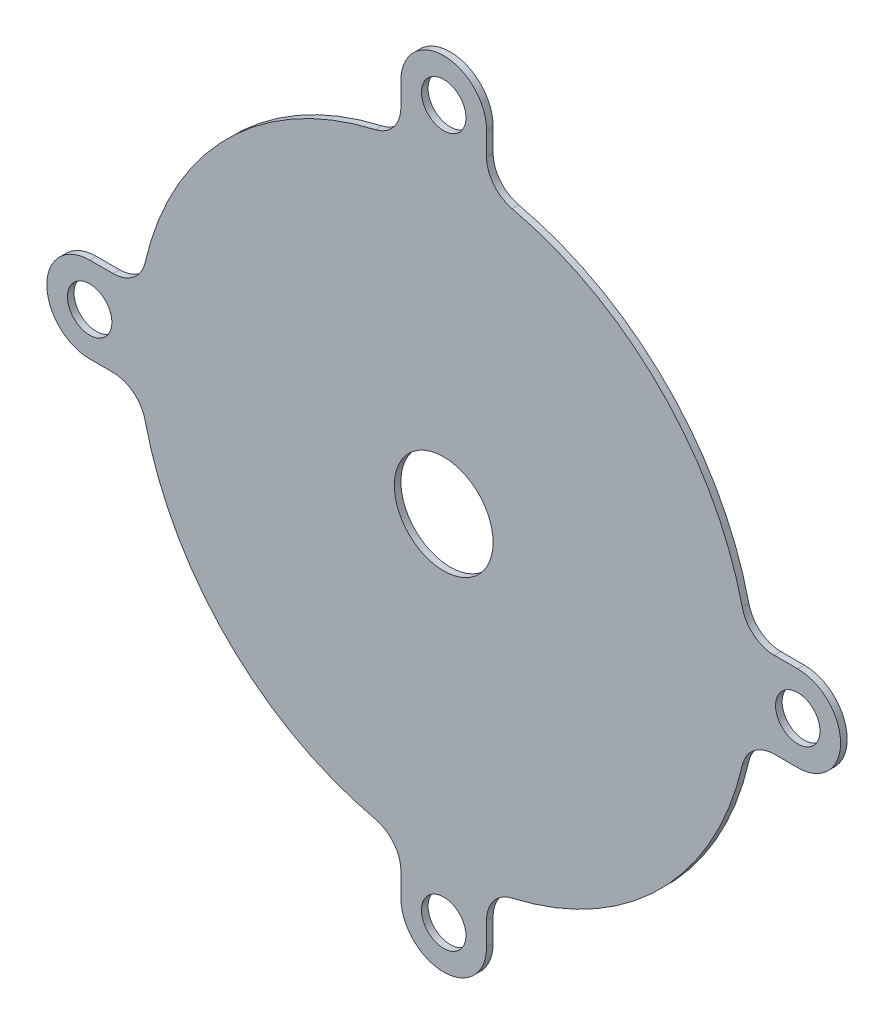
ISO-10303-21;
HEADER;
FILE_DESCRIPTION(('STEP AP214'),'2;1');
FILE_NAME('part.step','',(''),(''),'','','');
FILE_SCHEMA(('AUTOMOTIVE_DESIGN { 1 0 10303 214 1 1 1 1 }'));
ENDSEC;
DATA;
#1=APPLICATION_CONTEXT('core data for automotive mechanical design processes');
#2=APPLICATION_PROTOCOL_DEFINITION('international standard','automotive_design',2000,#1);
#3=PRODUCT_CONTEXT('',#1,'mechanical');
#4=PRODUCT('Part','Part','',(#3));
#5=PRODUCT_RELATED_PRODUCT_CATEGORY('part','',(#4));
#6=PRODUCT_DEFINITION_FORMATION('','',#4);
#7=PRODUCT_DEFINITION_CONTEXT('part definition',#1,'design');
#8=PRODUCT_DEFINITION('design','',#6,#7);
#9=PRODUCT_DEFINITION_SHAPE('','',#8);
#10=(LENGTH_UNIT() NAMED_UNIT(*) SI_UNIT(.MILLI.,.METRE.));
#11=(NAMED_UNIT(*) PLANE_ANGLE_UNIT() SI_UNIT($,.RADIAN.));
#12=(NAMED_UNIT(*) SI_UNIT($,.STERADIAN.) SOLID_ANGLE_UNIT());
#13=UNCERTAINTY_MEASURE_WITH_UNIT(LENGTH_MEASURE(1.E-05),#10,'distance_accuracy_value','');
#14=(GEOMETRIC_REPRESENTATION_CONTEXT(3) GLOBAL_UNCERTAINTY_ASSIGNED_CONTEXT((#13)) GLOBAL_UNIT_ASSIGNED_CONTEXT((#10,
#11,#12)) REPRESENTATION_CONTEXT('',''));
#15=CARTESIAN_POINT('',(0.,0.,0.));
#16=DIRECTION('',(0.,0.,1.));
#17=DIRECTION('',(1.,0.,0.));
#18=AXIS2_PLACEMENT_3D('',#15,#16,#17);
#19=CARTESIAN_POINT('',(-23.0000000000003,100.39920318409,-1.11022302462516E-13));
#20=DIRECTION('',(0.,0.,-1.));
#21=DIRECTION('',(-1.,0.,0.));
#22=AXIS2_PLACEMENT_3D('',#19,#20,#21);
#23=CYLINDRICAL_SURFACE('',#22,10.);
#24=DIRECTION('',(0.,0.,1.));
#25=VECTOR('',#24,1.);
#26=CARTESIAN_POINT('',(-13.0000000000002,100.39920318409,-1.94289029309402E-13));
#27=LINE('',#26,#25);
#28=CARTESIAN_POINT('',(-13.0000000000003,100.39920318409,-2.00000000000004));
#29=VERTEX_POINT('',#28);
#30=CARTESIAN_POINT('',(-13.0000000000002,100.39920318409,-1.94289029309402E-13));
#31=VERTEX_POINT('',#30);
#32=EDGE_CURVE('E11',#29,#31,#27,.T.);
#33=ORIENTED_EDGE('',*,*,#32,.F.);
#34=CARTESIAN_POINT('',(-23.0000000000003,100.39920318409,-2.00000000000012));
#35=DIRECTION('',(0.,0.,-1.));
#36=DIRECTION('',(-1.,0.,0.));
#37=AXIS2_PLACEMENT_3D('',#34,#35,#36);
#38=CIRCLE('',#37,10.);
#39=CARTESIAN_POINT('',(-20.7669902912628,90.6517077293242,-2.00000000000004));
#40=VERTEX_POINT('',#39);
#41=EDGE_CURVE('E159',#29,#40,#38,.T.);
#42=ORIENTED_EDGE('',*,*,#41,.T.);
#43=DIRECTION('',(0.,0.,1.));
#44=VECTOR('',#43,1.);
#45=CARTESIAN_POINT('',(-20.7669902912625,90.6517077293245,0.));
#46=LINE('',#45,#44);
#47=CARTESIAN_POINT('',(-20.7669902912625,90.6517077293245,0.));
#48=VERTEX_POINT('',#47);
#49=EDGE_CURVE('E53',#40,#48,#46,.T.);
#50=ORIENTED_EDGE('',*,*,#49,.T.);
#51=CARTESIAN_POINT('',(-23.0000000000003,100.39920318409,-1.11022302462516E-13));
#52=DIRECTION('',(0.,0.,-1.));
#53=DIRECTION('',(-1.00000000000001,0.,0.));
#54=AXIS2_PLACEMENT_3D('',#51,#52,#53);
#55=CIRCLE('',#54,10.);
#56=EDGE_CURVE('E346',#31,#48,#55,.T.);
#57=ORIENTED_EDGE('',*,*,#56,.F.);
#58=EDGE_LOOP('',(#33,#42,#50,#57));
#59=FACE_BOUND('',#58,.T.);
#60=ADVANCED_FACE('F42',(#59),#23,.F.);
#61=CARTESIAN_POINT('',(0.,0.,0.));
#62=DIRECTION('',(0.,0.,-1.));
#63=DIRECTION('',(-1.,0.,0.));
#64=AXIS2_PLACEMENT_3D('',#61,#62,#63);
#65=CYLINDRICAL_SURFACE('',#64,93.);
#66=ORIENTED_EDGE('',*,*,#49,.F.);
#67=CARTESIAN_POINT('',(0.,0.,-2.00000000000001));
#68=DIRECTION('',(0.,0.,1.));
#69=DIRECTION('',(1.,0.,0.));
#70=AXIS2_PLACEMENT_3D('',#67,#68,#69);
#71=CIRCLE('',#70,93.);
#72=CARTESIAN_POINT('',(-90.6517077293249,20.7669902912609,-2.00000000000006));
#73=VERTEX_POINT('',#72);
#74=EDGE_CURVE('E253',#40,#73,#71,.T.);
#75=ORIENTED_EDGE('',*,*,#74,.T.);
#76=DIRECTION('',(0.,0.,1.));
#77=VECTOR('',#76,1.);
#78=CARTESIAN_POINT('',(-90.6517077293239,20.7669902912621,-1.11022302462516E-13));
#79=LINE('',#78,#77);
#80=CARTESIAN_POINT('',(-90.6517077293239,20.7669902912621,-1.11022302462516E-13));
#81=VERTEX_POINT('',#80);
#82=EDGE_CURVE('E336',#73,#81,#79,.T.);
#83=ORIENTED_EDGE('',*,*,#82,.T.);
#84=CARTESIAN_POINT('',(0.,0.,0.));
#85=DIRECTION('',(0.,0.,1.));
#86=DIRECTION('',(-1.00000000000001,0.,0.));
#87=AXIS2_PLACEMENT_3D('',#84,#85,#86);
#88=CIRCLE('',#87,93.);
#89=EDGE_CURVE('E355',#48,#81,#88,.T.);
#90=ORIENTED_EDGE('',*,*,#89,.F.);
#91=EDGE_LOOP('',(#66,#75,#83,#90));
#92=FACE_BOUND('',#91,.T.);
#93=ADVANCED_FACE('F359',(#92),#65,.T.);
#94=CARTESIAN_POINT('',(-100.399203184092,23.0000000000002,-2.22044604925031E-13));
#95=DIRECTION('',(0.,0.,-1.));
#96=DIRECTION('',(-1.,0.,0.));
#97=AXIS2_PLACEMENT_3D('',#94,#95,#96);
#98=CYLINDRICAL_SURFACE('',#97,10.);
#99=ORIENTED_EDGE('',*,*,#82,.F.);
#100=CARTESIAN_POINT('',(-100.399203184092,23.0000000000002,-2.00000000000023));
#101=DIRECTION('',(0.,0.,-1.));
#102=DIRECTION('',(-1.,0.,0.));
#103=AXIS2_PLACEMENT_3D('',#100,#101,#102);
#104=CIRCLE('',#103,10.);
#105=CARTESIAN_POINT('',(-100.399203184093,12.9999999999987,-2.00000000000006));
#106=VERTEX_POINT('',#105);
#107=EDGE_CURVE('E249',#73,#106,#104,.T.);
#108=ORIENTED_EDGE('',*,*,#107,.T.);
#109=DIRECTION('',(0.,0.,1.));
#110=VECTOR('',#109,1.);
#111=CARTESIAN_POINT('',(-100.399203184092,13.0000000000001,0.));
#112=LINE('',#111,#110);
#113=CARTESIAN_POINT('',(-100.399203184092,13.0000000000001,0.));
#114=VERTEX_POINT('',#113);
#115=EDGE_CURVE('E332',#106,#114,#112,.T.);
#116=ORIENTED_EDGE('',*,*,#115,.T.);
#117=CARTESIAN_POINT('',(-100.399203184092,23.0000000000002,-2.22044604925031E-13));
#118=DIRECTION('',(0.,0.,-1.));
#119=DIRECTION('',(-1.00000000000001,0.,0.));
#120=AXIS2_PLACEMENT_3D('',#117,#118,#119);
#121=CIRCLE('',#120,10.);
#122=EDGE_CURVE('E361',#81,#114,#121,.T.);
#123=ORIENTED_EDGE('',*,*,#122,.F.);
#124=EDGE_LOOP('',(#99,#108,#116,#123));
#125=FACE_BOUND('',#124,.T.);
#126=ADVANCED_FACE('F482',(#125),#98,.F.);
#127=CARTESIAN_POINT('',(-92.0869154657729,13.0000000000001,-1.66533453693773E-13));
#128=DIRECTION('',(0.,-1.,0.));
#129=DIRECTION('',(-1.,0.,0.));
#130=AXIS2_PLACEMENT_3D('',#127,#128,#129);
#131=PLANE('',#130);
#132=ORIENTED_EDGE('',*,*,#115,.F.);
#133=DIRECTION('',(-1.00000000000001,0.,0.));
#134=VECTOR('',#133,1.);
#135=CARTESIAN_POINT('',(3.06791901487296E-13,12.9999999999988,-1.99999999999999));
#136=LINE('',#135,#134);
#137=CARTESIAN_POINT('',(-107.500000000002,12.9999999999989,-2.00000000000006));
#138=VERTEX_POINT('',#137);
#139=EDGE_CURVE('E245',#106,#138,#136,.T.);
#140=ORIENTED_EDGE('',*,*,#139,.T.);
#141=DIRECTION('',(0.,0.,1.));
#142=VECTOR('',#141,1.);
#143=CARTESIAN_POINT('',(-107.500000000001,13.0000000000002,-2.22044604925031E-13));
#144=LINE('',#143,#142);
#145=CARTESIAN_POINT('',(-107.500000000001,13.0000000000002,-2.22044604925031E-13));
#146=VERTEX_POINT('',#145);
#147=EDGE_CURVE('E328',#138,#146,#144,.T.);
#148=ORIENTED_EDGE('',*,*,#147,.T.);
#149=DIRECTION('',(-1.,0.,0.));
#150=VECTOR('',#149,1.);
#151=CARTESIAN_POINT('',(-92.0869154657729,13.0000000000001,-1.66533453693773E-13));
#152=LINE('',#151,#150);
#153=EDGE_CURVE('E365',#114,#146,#152,.T.);
#154=ORIENTED_EDGE('',*,*,#153,.F.);
#155=EDGE_LOOP('',(#132,#140,#148,#154));
#156=FACE_BOUND('',#155,.T.);
#157=ADVANCED_FACE('F487',(#156),#131,.F.);
#158=CARTESIAN_POINT('',(-107.500000000002,3.08486592682769E-13,-1.94289029309402E-13));
#159=DIRECTION('',(0.,0.,-1.));
#160=DIRECTION('',(-1.,0.,0.));
#161=AXIS2_PLACEMENT_3D('',#158,#159,#160);
#162=CYLINDRICAL_SURFACE('',#161,13.);
#163=ORIENTED_EDGE('',*,*,#147,.F.);
#164=CARTESIAN_POINT('',(-107.500000000002,3.07709436565531E-13,-2.0000000000002));
#165=DIRECTION('',(0.,0.,1.));
#166=DIRECTION('',(1.,0.,0.));
#167=AXIS2_PLACEMENT_3D('',#164,#165,#166);
#168=CIRCLE('',#167,13.);
#169=CARTESIAN_POINT('',(-107.500000000003,-13.000000000002,-2.00000000000005));
#170=VERTEX_POINT('',#169);
#171=EDGE_CURVE('E241',#138,#170,#168,.T.);
#172=ORIENTED_EDGE('',*,*,#171,.T.);
#173=DIRECTION('',(0.,0.,1.));
#174=VECTOR('',#173,1.);
#175=CARTESIAN_POINT('',(-107.500000000002,-13.0000000000003,-2.4980018054066E-13));
#176=LINE('',#175,#174);
#177=CARTESIAN_POINT('',(-107.500000000002,-13.0000000000003,-2.4980018054066E-13));
#178=VERTEX_POINT('',#177);
#179=EDGE_CURVE('E324',#170,#178,#176,.T.);
#180=ORIENTED_EDGE('',*,*,#179,.T.);
#181=CARTESIAN_POINT('',(-107.500000000002,3.08486592682769E-13,-1.94289029309402E-13));
#182=DIRECTION('',(0.,0.,1.));
#183=DIRECTION('',(-1.00000000000001,0.,0.));
#184=AXIS2_PLACEMENT_3D('',#181,#182,#183);
#185=CIRCLE('',#184,13.);
#186=EDGE_CURVE('E372',#146,#178,#185,.T.);
#187=ORIENTED_EDGE('',*,*,#186,.F.);
#188=EDGE_LOOP('',(#163,#172,#180,#187));
#189=FACE_BOUND('',#188,.T.);
#190=ADVANCED_FACE('F491',(#189),#162,.T.);
#191=CARTESIAN_POINT('',(-92.0869154657721,-13.0000000000003,0.));
#192=DIRECTION('',(0.,1.,0.));
#193=DIRECTION('',(1.00000000000001,0.,0.));
#194=AXIS2_PLACEMENT_3D('',#191,#192,#193);
#195=PLANE('',#194);
#196=ORIENTED_EDGE('',*,*,#179,.F.);
#197=DIRECTION('',(-1.00000000000001,0.,0.));
#198=VECTOR('',#197,1.);
#199=CARTESIAN_POINT('',(3.32771120263526E-13,-13.0000000000019,-1.99999999999998));
#200=LINE('',#199,#198);
#201=CARTESIAN_POINT('',(-100.399203184091,-13.0000000000018,-2.00000000000005));
#202=VERTEX_POINT('',#201);
#203=EDGE_CURVE('E237',#170,#202,#200,.F.);
#204=ORIENTED_EDGE('',*,*,#203,.T.);
#205=DIRECTION('',(0.,0.,1.));
#206=VECTOR('',#205,1.);
#207=CARTESIAN_POINT('',(-100.39920318409,-13.0000000000001,-1.94289029309402E-13));
#208=LINE('',#207,#206);
#209=CARTESIAN_POINT('',(-100.39920318409,-13.0000000000001,-1.94289029309402E-13));
#210=VERTEX_POINT('',#209);
#211=EDGE_CURVE('E320',#202,#210,#208,.T.);
#212=ORIENTED_EDGE('',*,*,#211,.T.);
#213=DIRECTION('',(1.00000000000001,0.,0.));
#214=VECTOR('',#213,1.);
#215=CARTESIAN_POINT('',(-92.0869154657721,-13.0000000000003,0.));
#216=LINE('',#215,#214);
#217=EDGE_CURVE('E376',#178,#210,#216,.T.);
#218=ORIENTED_EDGE('',*,*,#217,.F.);
#219=EDGE_LOOP('',(#196,#204,#212,#218));
#220=FACE_BOUND('',#219,.T.);
#221=ADVANCED_FACE('F495',(#220),#195,.F.);
#222=CARTESIAN_POINT('',(-100.39920318409,-23.0000000000005,-1.38777878078145E-13));
#223=DIRECTION('',(0.,0.,-1.));
#224=DIRECTION('',(-1.,0.,0.));
#225=AXIS2_PLACEMENT_3D('',#222,#223,#224);
#226=CYLINDRICAL_SURFACE('',#225,10.);
#227=ORIENTED_EDGE('',*,*,#211,.F.);
#228=CARTESIAN_POINT('',(-100.39920318409,-23.0000000000005,-2.00000000000015));
#229=DIRECTION('',(0.,0.,-1.));
#230=DIRECTION('',(-1.,0.,0.));
#231=AXIS2_PLACEMENT_3D('',#228,#229,#230);
#232=CIRCLE('',#231,10.);
#233=CARTESIAN_POINT('',(-90.6517077293253,-20.7669902912643,-2.00000000000004));
#234=VERTEX_POINT('',#233);
#235=EDGE_CURVE('E233',#202,#234,#232,.T.);
#236=ORIENTED_EDGE('',*,*,#235,.T.);
#237=DIRECTION('',(0.,0.,1.));
#238=VECTOR('',#237,1.);
#239=CARTESIAN_POINT('',(-90.6517077293243,-20.7669902912625,-1.11022302462516E-13));
#240=LINE('',#239,#238);
#241=CARTESIAN_POINT('',(-90.6517077293243,-20.7669902912625,-1.11022302462516E-13));
#242=VERTEX_POINT('',#241);
#243=EDGE_CURVE('E316',#234,#242,#240,.T.);
#244=ORIENTED_EDGE('',*,*,#243,.T.);
#245=CARTESIAN_POINT('',(-100.39920318409,-23.0000000000005,-1.38777878078145E-13));
#246=DIRECTION('',(0.,0.,-1.));
#247=DIRECTION('',(-1.00000000000001,0.,0.));
#248=AXIS2_PLACEMENT_3D('',#245,#246,#247);
#249=CIRCLE('',#248,10.);
#250=EDGE_CURVE('E380',#210,#242,#249,.T.);
#251=ORIENTED_EDGE('',*,*,#250,.F.);
#252=EDGE_LOOP('',(#227,#236,#244,#251));
#253=FACE_BOUND('',#252,.T.);
#254=ADVANCED_FACE('F499',(#253),#226,.F.);
#255=CARTESIAN_POINT('',(0.,0.,0.));
#256=DIRECTION('',(0.,0.,-1.));
#257=DIRECTION('',(-1.,0.,0.));
#258=AXIS2_PLACEMENT_3D('',#255,#256,#257);
#259=CYLINDRICAL_SURFACE('',#258,93.);
#260=ORIENTED_EDGE('',*,*,#243,.F.);
#261=CARTESIAN_POINT('',(0.,0.,-2.00000000000001));
#262=DIRECTION('',(0.,0.,1.));
#263=DIRECTION('',(1.,0.,0.));
#264=AXIS2_PLACEMENT_3D('',#261,#262,#263);
#265=CIRCLE('',#264,93.);
#266=CARTESIAN_POINT('',(-20.7669902912625,-90.6517077293271,-1.99999999999997));
#267=VERTEX_POINT('',#266);
#268=EDGE_CURVE('E229',#234,#267,#265,.T.);
#269=ORIENTED_EDGE('',*,*,#268,.T.);
#270=DIRECTION('',(0.,0.,1.));
#271=VECTOR('',#270,1.);
#272=CARTESIAN_POINT('',(-20.7669902912623,-90.6517077293244,2.4980018054066E-13));
#273=LINE('',#272,#271);
#274=CARTESIAN_POINT('',(-20.7669902912623,-90.6517077293244,2.4980018054066E-13));
#275=VERTEX_POINT('',#274);
#276=EDGE_CURVE('E312',#267,#275,#273,.T.);
#277=ORIENTED_EDGE('',*,*,#276,.T.);
#278=CARTESIAN_POINT('',(0.,0.,0.));
#279=DIRECTION('',(0.,0.,1.));
#280=DIRECTION('',(-1.00000000000001,0.,0.));
#281=AXIS2_PLACEMENT_3D('',#278,#279,#280);
#282=CIRCLE('',#281,93.);
#283=EDGE_CURVE('E384',#242,#275,#282,.T.);
#284=ORIENTED_EDGE('',*,*,#283,.F.);
#285=EDGE_LOOP('',(#260,#269,#277,#284));
#286=FACE_BOUND('',#285,.T.);
#287=ADVANCED_FACE('F503',(#286),#259,.T.);
#288=CARTESIAN_POINT('',(-23.0000000000002,-100.399203184091,-1.38777878078145E-13));
#289=DIRECTION('',(0.,0.,-1.));
#290=DIRECTION('',(-1.,0.,0.));
#291=AXIS2_PLACEMENT_3D('',#288,#289,#290);
#292=CYLINDRICAL_SURFACE('',#291,10.);
#293=ORIENTED_EDGE('',*,*,#276,.F.);
#294=CARTESIAN_POINT('',(-23.0000000000002,-100.399203184091,-2.00000000000015));
#295=DIRECTION('',(0.,0.,-1.));
#296=DIRECTION('',(-1.,0.,0.));
#297=AXIS2_PLACEMENT_3D('',#294,#295,#296);
#298=CIRCLE('',#297,10.);
#299=CARTESIAN_POINT('',(-13.0000000000004,-100.399203184094,-1.99999999999996));
#300=VERTEX_POINT('',#299);
#301=EDGE_CURVE('E225',#267,#300,#298,.T.);
#302=ORIENTED_EDGE('',*,*,#301,.T.);
#303=DIRECTION('',(0.,0.,1.));
#304=VECTOR('',#303,1.);
#305=CARTESIAN_POINT('',(-13.0000000000003,-100.399203184091,-1.94289029309402E-13));
#306=LINE('',#305,#304);
#307=CARTESIAN_POINT('',(-13.0000000000003,-100.399203184091,-1.94289029309402E-13));
#308=VERTEX_POINT('',#307);
#309=EDGE_CURVE('E308',#300,#308,#306,.T.);
#310=ORIENTED_EDGE('',*,*,#309,.T.);
#311=CARTESIAN_POINT('',(-23.0000000000002,-100.399203184091,-1.38777878078145E-13));
#312=DIRECTION('',(0.,0.,-1.));
#313=DIRECTION('',(-1.00000000000001,0.,0.));
#314=AXIS2_PLACEMENT_3D('',#311,#312,#313);
#315=CIRCLE('',#314,10.);
#316=EDGE_CURVE('E388',#275,#308,#315,.T.);
#317=ORIENTED_EDGE('',*,*,#316,.F.);
#318=EDGE_LOOP('',(#293,#302,#310,#317));
#319=FACE_BOUND('',#318,.T.);
#320=ADVANCED_FACE('F507',(#319),#292,.F.);
#321=CARTESIAN_POINT('',(-12.9999999999999,-92.0869154657719,-1.38777878078145E-13));
#322=DIRECTION('',(1.,0.,0.));
#323=DIRECTION('',(0.,-1.,0.));
#324=AXIS2_PLACEMENT_3D('',#321,#322,#323);
#325=PLANE('',#324);
#326=ORIENTED_EDGE('',*,*,#309,.F.);
#327=DIRECTION('',(0.,1.00000000000001,0.));
#328=VECTOR('',#327,1.);
#329=CARTESIAN_POINT('',(-13.0000000000006,107.500000000002,-2.00000000000004));
#330=LINE('',#329,#328);
#331=CARTESIAN_POINT('',(-13.0000000000004,-107.500000000005,-1.99999999999996));
#332=VERTEX_POINT('',#331);
#333=EDGE_CURVE('E221',#300,#332,#330,.F.);
#334=ORIENTED_EDGE('',*,*,#333,.T.);
#335=DIRECTION('',(0.,0.,1.));
#336=VECTOR('',#335,1.);
#337=CARTESIAN_POINT('',(-13.0000000000003,-107.500000000002,-1.94289029309402E-13));
#338=LINE('',#337,#336);
#339=CARTESIAN_POINT('',(-13.0000000000003,-107.500000000002,-1.94289029309402E-13));
#340=VERTEX_POINT('',#339);
#341=EDGE_CURVE('E304',#332,#340,#338,.T.);
#342=ORIENTED_EDGE('',*,*,#341,.T.);
#343=DIRECTION('',(0.,-1.,0.));
#344=VECTOR('',#343,1.);
#345=CARTESIAN_POINT('',(-12.9999999999999,-92.0869154657719,-1.38777878078145E-13));
#346=LINE('',#345,#344);
#347=EDGE_CURVE('E392',#308,#340,#346,.T.);
#348=ORIENTED_EDGE('',*,*,#347,.F.);
#349=EDGE_LOOP('',(#326,#334,#342,#348));
#350=FACE_BOUND('',#349,.T.);
#351=ADVANCED_FACE('F511',(#350),#325,.F.);
#352=CARTESIAN_POINT('',(-3.81796173960844E-13,-107.500000000002,0.));
#353=DIRECTION('',(0.,0.,-1.));
#354=DIRECTION('',(-1.,0.,0.));
#355=AXIS2_PLACEMENT_3D('',#352,#353,#354);
#356=CYLINDRICAL_SURFACE('',#355,13.);
#357=ORIENTED_EDGE('',*,*,#341,.F.);
#358=CARTESIAN_POINT('',(-3.84377442493097E-13,-107.500000000002,-2.00000000000006));
#359=DIRECTION('',(0.,0.,1.));
#360=DIRECTION('',(1.,0.,0.));
#361=AXIS2_PLACEMENT_3D('',#358,#359,#360);
#362=CIRCLE('',#361,13.);
#363=CARTESIAN_POINT('',(13.0000000000002,-107.500000000005,-1.99999999999994));
#364=VERTEX_POINT('',#363);
#365=EDGE_CURVE('E217',#332,#364,#362,.T.);
#366=ORIENTED_EDGE('',*,*,#365,.T.);
#367=DIRECTION('',(0.,0.,1.));
#368=VECTOR('',#367,1.);
#369=CARTESIAN_POINT('',(13.,-107.500000000002,0.));
#370=LINE('',#369,#368);
#371=CARTESIAN_POINT('',(13.,-107.500000000002,0.));
#372=VERTEX_POINT('',#371);
#373=EDGE_CURVE('E300',#364,#372,#370,.T.);
#374=ORIENTED_EDGE('',*,*,#373,.T.);
#375=CARTESIAN_POINT('',(-3.81796173960844E-13,-107.500000000002,0.));
#376=DIRECTION('',(0.,0.,1.));
#377=DIRECTION('',(-1.00000000000001,0.,0.));
#378=AXIS2_PLACEMENT_3D('',#375,#376,#377);
#379=CIRCLE('',#378,13.);
#380=EDGE_CURVE('E396',#340,#372,#379,.T.);
#381=ORIENTED_EDGE('',*,*,#380,.F.);
#382=EDGE_LOOP('',(#357,#366,#374,#381));
#383=FACE_BOUND('',#382,.T.);
#384=ADVANCED_FACE('F515',(#383),#356,.T.);
#385=CARTESIAN_POINT('',(13.0000000000001,-92.0869154657725,0.));
#386=DIRECTION('',(-1.,0.,0.));
#387=DIRECTION('',(0.,1.,0.));
#388=AXIS2_PLACEMENT_3D('',#385,#386,#387);
#389=PLANE('',#388);
#390=ORIENTED_EDGE('',*,*,#373,.F.);
#391=DIRECTION('',(0.,1.00000000000001,0.));
#392=VECTOR('',#391,1.);
#393=CARTESIAN_POINT('',(12.9999999999999,107.500000000002,-2.00000000000002));
#394=LINE('',#393,#392);
#395=CARTESIAN_POINT('',(13.0000000000001,-100.399203184094,-1.99999999999994));
#396=VERTEX_POINT('',#395);
#397=EDGE_CURVE('E213',#364,#396,#394,.T.);
#398=ORIENTED_EDGE('',*,*,#397,.T.);
#399=DIRECTION('',(0.,0.,1.));
#400=VECTOR('',#399,1.);
#401=CARTESIAN_POINT('',(12.9999999999999,-100.399203184091,-1.38777878078145E-13));
#402=LINE('',#401,#400);
#403=CARTESIAN_POINT('',(12.9999999999999,-100.399203184091,-1.38777878078145E-13));
#404=VERTEX_POINT('',#403);
#405=EDGE_CURVE('E296',#396,#404,#402,.T.);
#406=ORIENTED_EDGE('',*,*,#405,.T.);
#407=DIRECTION('',(0.,1.,0.));
#408=VECTOR('',#407,1.);
#409=CARTESIAN_POINT('',(13.0000000000001,-92.0869154657725,0.));
#410=LINE('',#409,#408);
#411=EDGE_CURVE('E400',#372,#404,#410,.T.);
#412=ORIENTED_EDGE('',*,*,#411,.F.);
#413=EDGE_LOOP('',(#390,#398,#406,#412));
#414=FACE_BOUND('',#413,.T.);
#415=ADVANCED_FACE('F519',(#414),#389,.F.);
#416=CARTESIAN_POINT('',(23.0000000000003,-100.399203184091,0.));
#417=DIRECTION('',(0.,0.,-1.));
#418=DIRECTION('',(-1.,0.,0.));
#419=AXIS2_PLACEMENT_3D('',#416,#417,#418);
#420=CYLINDRICAL_SURFACE('',#419,10.);
#421=ORIENTED_EDGE('',*,*,#405,.F.);
#422=CARTESIAN_POINT('',(23.0000000000003,-100.399203184091,-2.00000000000009));
#423=DIRECTION('',(0.,0.,-1.));
#424=DIRECTION('',(-1.,0.,0.));
#425=AXIS2_PLACEMENT_3D('',#422,#423,#424);
#426=CIRCLE('',#425,10.);
#427=CARTESIAN_POINT('',(20.7669902912625,-90.6517077293275,-1.99999999999994));
#428=VERTEX_POINT('',#427);
#429=EDGE_CURVE('E209',#396,#428,#426,.T.);
#430=ORIENTED_EDGE('',*,*,#429,.T.);
#431=DIRECTION('',(0.,0.,1.));
#432=VECTOR('',#431,1.);
#433=CARTESIAN_POINT('',(20.7669902912623,-90.6517077293248,-2.22044604925031E-13));
#434=LINE('',#433,#432);
#435=CARTESIAN_POINT('',(20.7669902912623,-90.6517077293248,-2.22044604925031E-13));
#436=VERTEX_POINT('',#435);
#437=EDGE_CURVE('E292',#428,#436,#434,.T.);
#438=ORIENTED_EDGE('',*,*,#437,.T.);
#439=CARTESIAN_POINT('',(23.0000000000003,-100.399203184091,0.));
#440=DIRECTION('',(0.,0.,-1.));
#441=DIRECTION('',(-1.00000000000001,0.,0.));
#442=AXIS2_PLACEMENT_3D('',#439,#440,#441);
#443=CIRCLE('',#442,10.);
#444=EDGE_CURVE('E404',#404,#436,#443,.T.);
#445=ORIENTED_EDGE('',*,*,#444,.F.);
#446=EDGE_LOOP('',(#421,#430,#438,#445));
#447=FACE_BOUND('',#446,.T.);
#448=ADVANCED_FACE('F523',(#447),#420,.F.);
#449=CARTESIAN_POINT('',(0.,0.,0.));
#450=DIRECTION('',(0.,0.,-1.));
#451=DIRECTION('',(-1.,0.,0.));
#452=AXIS2_PLACEMENT_3D('',#449,#450,#451);
#453=CYLINDRICAL_SURFACE('',#452,93.);
#454=ORIENTED_EDGE('',*,*,#437,.F.);
#455=CARTESIAN_POINT('',(0.,0.,-2.00000000000001));
#456=DIRECTION('',(0.,0.,1.));
#457=DIRECTION('',(1.,0.,0.));
#458=AXIS2_PLACEMENT_3D('',#455,#456,#457);
#459=CIRCLE('',#458,93.);
#460=CARTESIAN_POINT('',(90.6517077293249,-20.766990291264,-1.99999999999992));
#461=VERTEX_POINT('',#460);
#462=EDGE_CURVE('E205',#428,#461,#459,.T.);
#463=ORIENTED_EDGE('',*,*,#462,.T.);
#464=DIRECTION('',(0.,0.,1.));
#465=VECTOR('',#464,1.);
#466=CARTESIAN_POINT('',(90.6517077293239,-20.7669902912623,1.94289029309402E-13));
#467=LINE('',#466,#465);
#468=CARTESIAN_POINT('',(90.6517077293239,-20.7669902912623,1.94289029309402E-13));
#469=VERTEX_POINT('',#468);
#470=EDGE_CURVE('E288',#461,#469,#467,.T.);
#471=ORIENTED_EDGE('',*,*,#470,.T.);
#472=CARTESIAN_POINT('',(0.,0.,0.));
#473=DIRECTION('',(0.,0.,1.));
#474=DIRECTION('',(-1.00000000000001,0.,0.));
#475=AXIS2_PLACEMENT_3D('',#472,#473,#474);
#476=CIRCLE('',#475,93.);
#477=EDGE_CURVE('E408',#436,#469,#476,.T.);
#478=ORIENTED_EDGE('',*,*,#477,.F.);
#479=EDGE_LOOP('',(#454,#463,#471,#478));
#480=FACE_BOUND('',#479,.T.);
#481=ADVANCED_FACE('F527',(#480),#453,.T.);
#482=CARTESIAN_POINT('',(100.39920318409,-22.9999999999998,0.));
#483=DIRECTION('',(0.,0.,-1.));
#484=DIRECTION('',(-1.,0.,0.));
#485=AXIS2_PLACEMENT_3D('',#482,#483,#484);
#486=CYLINDRICAL_SURFACE('',#485,10.);
#487=ORIENTED_EDGE('',*,*,#470,.F.);
#488=CARTESIAN_POINT('',(100.39920318409,-22.9999999999998,-1.99999999999998));
#489=DIRECTION('',(0.,0.,-1.));
#490=DIRECTION('',(-1.,0.,0.));
#491=AXIS2_PLACEMENT_3D('',#488,#489,#490);
#492=CIRCLE('',#491,10.);
#493=CARTESIAN_POINT('',(100.399203184091,-13.0000000000016,-1.99999999999992));
#494=VERTEX_POINT('',#493);
#495=EDGE_CURVE('E201',#461,#494,#492,.T.);
#496=ORIENTED_EDGE('',*,*,#495,.T.);
#497=DIRECTION('',(0.,0.,1.));
#498=VECTOR('',#497,1.);
#499=CARTESIAN_POINT('',(100.39920318409,-12.9999999999999,0.));
#500=LINE('',#499,#498);
#501=CARTESIAN_POINT('',(100.39920318409,-12.9999999999999,0.));
#502=VERTEX_POINT('',#501);
#503=EDGE_CURVE('E284',#494,#502,#500,.T.);
#504=ORIENTED_EDGE('',*,*,#503,.T.);
#505=CARTESIAN_POINT('',(100.39920318409,-22.9999999999998,0.));
#506=DIRECTION('',(0.,0.,-1.));
#507=DIRECTION('',(-1.00000000000001,0.,0.));
#508=AXIS2_PLACEMENT_3D('',#505,#506,#507);
#509=CIRCLE('',#508,10.);
#510=EDGE_CURVE('E412',#469,#502,#509,.T.);
#511=ORIENTED_EDGE('',*,*,#510,.F.);
#512=EDGE_LOOP('',(#487,#496,#504,#511));
#513=FACE_BOUND('',#512,.T.);
#514=ADVANCED_FACE('F531',(#513),#486,.F.);
#515=CARTESIAN_POINT('',(92.086915465771,-12.9999999999999,0.));
#516=DIRECTION('',(0.,1.,0.));
#517=DIRECTION('',(1.,0.,0.));
#518=AXIS2_PLACEMENT_3D('',#515,#516,#517);
#519=PLANE('',#518);
#520=ORIENTED_EDGE('',*,*,#503,.F.);
#521=DIRECTION('',(-1.00000000000001,0.,0.));
#522=VECTOR('',#521,1.);
#523=CARTESIAN_POINT('',(3.32771120263525E-13,-13.0000000000017,-1.99999999999998));
#524=LINE('',#523,#522);
#525=CARTESIAN_POINT('',(107.500000000002,-13.0000000000014,-1.99999999999991));
#526=VERTEX_POINT('',#525);
#527=EDGE_CURVE('E197',#494,#526,#524,.F.);
#528=ORIENTED_EDGE('',*,*,#527,.T.);
#529=DIRECTION('',(0.,0.,1.));
#530=VECTOR('',#529,1.);
#531=CARTESIAN_POINT('',(107.500000000001,-12.9999999999997,0.));
#532=LINE('',#531,#530);
#533=CARTESIAN_POINT('',(107.500000000001,-12.9999999999997,0.));
#534=VERTEX_POINT('',#533);
#535=EDGE_CURVE('E280',#526,#534,#532,.T.);
#536=ORIENTED_EDGE('',*,*,#535,.T.);
#537=DIRECTION('',(1.,0.,0.));
#538=VECTOR('',#537,1.);
#539=CARTESIAN_POINT('',(92.086915465771,-12.9999999999999,0.));
#540=LINE('',#539,#538);
#541=EDGE_CURVE('E416',#502,#534,#540,.T.);
#542=ORIENTED_EDGE('',*,*,#541,.F.);
#543=EDGE_LOOP('',(#520,#528,#536,#542));
#544=FACE_BOUND('',#543,.T.);
#545=ADVANCED_FACE('F535',(#544),#519,.F.);
#546=CARTESIAN_POINT('',(107.500000000001,1.5583092679681E-13,0.));
#547=DIRECTION('',(0.,0.,-1.));
#548=DIRECTION('',(-1.,0.,0.));
#549=AXIS2_PLACEMENT_3D('',#546,#547,#548);
#550=CYLINDRICAL_SURFACE('',#549,13.);
#551=ORIENTED_EDGE('',*,*,#535,.F.);
#552=CARTESIAN_POINT('',(107.500000000001,1.55053770679572E-13,-1.99999999999998));
#553=DIRECTION('',(0.,0.,1.));
#554=DIRECTION('',(1.,0.,0.));
#555=AXIS2_PLACEMENT_3D('',#552,#553,#554);
#556=CIRCLE('',#555,13.);
#557=CARTESIAN_POINT('',(107.500000000002,12.9999999999995,-1.99999999999992));
#558=VERTEX_POINT('',#557);
#559=EDGE_CURVE('E193',#526,#558,#556,.T.);
#560=ORIENTED_EDGE('',*,*,#559,.T.);
#561=DIRECTION('',(0.,0.,1.));
#562=VECTOR('',#561,1.);
#563=CARTESIAN_POINT('',(107.500000000001,13.0000000000008,0.));
#564=LINE('',#563,#562);
#565=CARTESIAN_POINT('',(107.500000000001,13.0000000000008,0.));
#566=VERTEX_POINT('',#565);
#567=EDGE_CURVE('E276',#558,#566,#564,.T.);
#568=ORIENTED_EDGE('',*,*,#567,.T.);
#569=CARTESIAN_POINT('',(107.500000000001,1.5583092679681E-13,0.));
#570=DIRECTION('',(0.,0.,1.));
#571=DIRECTION('',(-1.00000000000001,0.,0.));
#572=AXIS2_PLACEMENT_3D('',#569,#570,#571);
#573=CIRCLE('',#572,13.);
#574=EDGE_CURVE('E420',#534,#566,#573,.T.);
#575=ORIENTED_EDGE('',*,*,#574,.F.);
#576=EDGE_LOOP('',(#551,#560,#568,#575));
#577=FACE_BOUND('',#576,.T.);
#578=ADVANCED_FACE('F539',(#577),#550,.T.);
#579=CARTESIAN_POINT('',(92.0869154657712,13.0000000000004,0.));
#580=DIRECTION('',(0.,-1.,0.));
#581=DIRECTION('',(-1.,0.,0.));
#582=AXIS2_PLACEMENT_3D('',#579,#580,#581);
#583=PLANE('',#582);
#584=ORIENTED_EDGE('',*,*,#567,.F.);
#585=DIRECTION('',(-1.00000000000001,0.,0.));
#586=VECTOR('',#585,1.);
#587=CARTESIAN_POINT('',(3.06791901487296E-13,12.9999999999994,-1.99999999999999));
#588=LINE('',#587,#586);
#589=CARTESIAN_POINT('',(100.399203184091,12.9999999999992,-1.99999999999993));
#590=VERTEX_POINT('',#589);
#591=EDGE_CURVE('E189',#558,#590,#588,.T.);
#592=ORIENTED_EDGE('',*,*,#591,.T.);
#593=DIRECTION('',(0.,0.,1.));
#594=VECTOR('',#593,1.);
#595=CARTESIAN_POINT('',(100.39920318409,13.0000000000005,0.));
#596=LINE('',#595,#594);
#597=CARTESIAN_POINT('',(100.39920318409,13.0000000000005,0.));
#598=VERTEX_POINT('',#597);
#599=EDGE_CURVE('E272',#590,#598,#596,.T.);
#600=ORIENTED_EDGE('',*,*,#599,.T.);
#601=DIRECTION('',(-1.,0.,0.));
#602=VECTOR('',#601,1.);
#603=CARTESIAN_POINT('',(92.0869154657712,13.0000000000004,0.));
#604=LINE('',#603,#602);
#605=EDGE_CURVE('E424',#566,#598,#604,.T.);
#606=ORIENTED_EDGE('',*,*,#605,.F.);
#607=EDGE_LOOP('',(#584,#592,#600,#606));
#608=FACE_BOUND('',#607,.T.);
#609=ADVANCED_FACE('F543',(#608),#583,.F.);
#610=CARTESIAN_POINT('',(100.39920318409,23.0000000000008,1.11022302462516E-13));
#611=DIRECTION('',(0.,0.,-1.));
#612=DIRECTION('',(-1.,0.,0.));
#613=AXIS2_PLACEMENT_3D('',#610,#611,#612);
#614=CYLINDRICAL_SURFACE('',#613,10.);
#615=ORIENTED_EDGE('',*,*,#599,.F.);
#616=CARTESIAN_POINT('',(100.39920318409,23.0000000000008,-1.9999999999999));
#617=DIRECTION('',(0.,0.,-1.));
#618=DIRECTION('',(-1.,0.,0.));
#619=AXIS2_PLACEMENT_3D('',#616,#617,#618);
#620=CIRCLE('',#619,10.);
#621=CARTESIAN_POINT('',(90.6517077293251,20.7669902912615,-1.99999999999994));
#622=VERTEX_POINT('',#621);
#623=EDGE_CURVE('E185',#590,#622,#620,.T.);
#624=ORIENTED_EDGE('',*,*,#623,.T.);
#625=DIRECTION('',(0.,0.,1.));
#626=VECTOR('',#625,1.);
#627=CARTESIAN_POINT('',(90.6517077293242,20.7669902912627,0.));
#628=LINE('',#627,#626);
#629=CARTESIAN_POINT('',(90.6517077293242,20.7669902912627,0.));
#630=VERTEX_POINT('',#629);
#631=EDGE_CURVE('E268',#622,#630,#628,.T.);
#632=ORIENTED_EDGE('',*,*,#631,.T.);
#633=CARTESIAN_POINT('',(100.39920318409,23.0000000000008,1.11022302462516E-13));
#634=DIRECTION('',(0.,0.,-1.));
#635=DIRECTION('',(-1.00000000000001,0.,0.));
#636=AXIS2_PLACEMENT_3D('',#633,#634,#635);
#637=CIRCLE('',#636,10.);
#638=EDGE_CURVE('E428',#598,#630,#637,.T.);
#639=ORIENTED_EDGE('',*,*,#638,.F.);
#640=EDGE_LOOP('',(#615,#624,#632,#639));
#641=FACE_BOUND('',#640,.T.);
#642=ADVANCED_FACE('F547',(#641),#614,.F.);
#643=CARTESIAN_POINT('',(0.,0.,0.));
#644=DIRECTION('',(0.,0.,-1.));
#645=DIRECTION('',(-1.,0.,0.));
#646=AXIS2_PLACEMENT_3D('',#643,#644,#645);
#647=CYLINDRICAL_SURFACE('',#646,93.);
#648=ORIENTED_EDGE('',*,*,#631,.F.);
#649=CARTESIAN_POINT('',(0.,0.,-2.00000000000001));
#650=DIRECTION('',(0.,0.,1.));
#651=DIRECTION('',(1.,0.,0.));
#652=AXIS2_PLACEMENT_3D('',#649,#650,#651);
#653=CIRCLE('',#652,93.);
#654=CARTESIAN_POINT('',(20.7669902912628,90.6517077293239,-2.00000000000001));
#655=VERTEX_POINT('',#654);
#656=EDGE_CURVE('E181',#622,#655,#653,.T.);
#657=ORIENTED_EDGE('',*,*,#656,.T.);
#658=DIRECTION('',(0.,0.,1.));
#659=VECTOR('',#658,1.);
#660=CARTESIAN_POINT('',(20.7669902912625,90.6517077293242,0.));
#661=LINE('',#660,#659);
#662=CARTESIAN_POINT('',(20.7669902912625,90.6517077293242,0.));
#663=VERTEX_POINT('',#662);
#664=EDGE_CURVE('E264',#655,#663,#661,.T.);
#665=ORIENTED_EDGE('',*,*,#664,.T.);
#666=CARTESIAN_POINT('',(0.,0.,0.));
#667=DIRECTION('',(0.,0.,1.));
#668=DIRECTION('',(-1.00000000000001,0.,0.));
#669=AXIS2_PLACEMENT_3D('',#666,#667,#668);
#670=CIRCLE('',#669,93.);
#671=EDGE_CURVE('E432',#630,#663,#670,.T.);
#672=ORIENTED_EDGE('',*,*,#671,.F.);
#673=EDGE_LOOP('',(#648,#657,#665,#672));
#674=FACE_BOUND('',#673,.T.);
#675=ADVANCED_FACE('F551',(#674),#647,.T.);
#676=CARTESIAN_POINT('',(23.0000000000007,100.39920318409,0.));
#677=DIRECTION('',(0.,0.,-1.));
#678=DIRECTION('',(-1.,0.,0.));
#679=AXIS2_PLACEMENT_3D('',#676,#677,#678);
#680=CYLINDRICAL_SURFACE('',#679,10.);
#681=ORIENTED_EDGE('',*,*,#664,.F.);
#682=CARTESIAN_POINT('',(23.0000000000007,100.39920318409,-1.99999999999995));
#683=DIRECTION('',(0.,0.,-1.));
#684=DIRECTION('',(-1.,0.,0.));
#685=AXIS2_PLACEMENT_3D('',#682,#683,#684);
#686=CIRCLE('',#685,10.);
#687=CARTESIAN_POINT('',(13.0000000000003,100.39920318409,-2.00000000000002));
#688=VERTEX_POINT('',#687);
#689=EDGE_CURVE('E177',#655,#688,#686,.T.);
#690=ORIENTED_EDGE('',*,*,#689,.T.);
#691=DIRECTION('',(0.,0.,1.));
#692=VECTOR('',#691,1.);
#693=CARTESIAN_POINT('',(13.0000000000002,100.39920318409,0.));
#694=LINE('',#693,#692);
#695=CARTESIAN_POINT('',(13.0000000000002,100.39920318409,0.));
#696=VERTEX_POINT('',#695);
#697=EDGE_CURVE('E261',#688,#696,#694,.T.);
#698=ORIENTED_EDGE('',*,*,#697,.T.);
#699=CARTESIAN_POINT('',(23.0000000000007,100.39920318409,0.));
#700=DIRECTION('',(0.,0.,-1.));
#701=DIRECTION('',(-1.00000000000001,0.,0.));
#702=AXIS2_PLACEMENT_3D('',#699,#700,#701);
#703=CIRCLE('',#702,10.);
#704=EDGE_CURVE('E436',#663,#696,#703,.T.);
#705=ORIENTED_EDGE('',*,*,#704,.F.);
#706=EDGE_LOOP('',(#681,#690,#698,#705));
#707=FACE_BOUND('',#706,.T.);
#708=ADVANCED_FACE('F555',(#707),#680,.F.);
#709=CARTESIAN_POINT('',(13.0000000000004,92.0869154657722,0.));
#710=DIRECTION('',(-1.,0.,0.));
#711=DIRECTION('',(0.,1.,0.));
#712=AXIS2_PLACEMENT_3D('',#709,#710,#711);
#713=PLANE('',#712);
#714=ORIENTED_EDGE('',*,*,#697,.F.);
#715=DIRECTION('',(0.,1.00000000000001,0.));
#716=VECTOR('',#715,1.);
#717=CARTESIAN_POINT('',(13.0000000000003,107.500000000002,-2.00000000000002));
#718=LINE('',#717,#716);
#719=CARTESIAN_POINT('',(13.0000000000006,107.500000000002,-2.00000000000002));
#720=VERTEX_POINT('',#719);
#721=EDGE_CURVE('E173',#688,#720,#718,.T.);
#722=ORIENTED_EDGE('',*,*,#721,.T.);
#723=DIRECTION('',(0.,0.,1.));
#724=VECTOR('',#723,1.);
#725=CARTESIAN_POINT('',(13.0000000000004,107.500000000002,1.11022302462516E-13));
#726=LINE('',#725,#724);
#727=CARTESIAN_POINT('',(13.0000000000004,107.500000000002,1.11022302462516E-13));
#728=VERTEX_POINT('',#727);
#729=EDGE_CURVE('E61',#720,#728,#726,.T.);
#730=ORIENTED_EDGE('',*,*,#729,.T.);
#731=DIRECTION('',(0.,1.,0.));
#732=VECTOR('',#731,1.);
#733=CARTESIAN_POINT('',(13.0000000000004,92.0869154657722,0.));
#734=LINE('',#733,#732);
#735=EDGE_CURVE('E152',#696,#728,#734,.T.);
#736=ORIENTED_EDGE('',*,*,#735,.F.);
#737=EDGE_LOOP('',(#714,#722,#730,#736));
#738=FACE_BOUND('',#737,.T.);
#739=ADVANCED_FACE('F559',(#738),#713,.F.);
#740=CARTESIAN_POINT('',(2.14948701775178E-13,107.500000000002,0.));
#741=DIRECTION('',(0.,0.,-1.));
#742=DIRECTION('',(-1.,0.,0.));
#743=AXIS2_PLACEMENT_3D('',#740,#741,#742);
#744=CYLINDRICAL_SURFACE('',#743,13.);
#745=ORIENTED_EDGE('',*,*,#729,.F.);
#746=CARTESIAN_POINT('',(2.12367433242924E-13,107.500000000002,-2.00000000000004));
#747=DIRECTION('',(0.,0.,1.));
#748=DIRECTION('',(1.,0.,0.));
#749=AXIS2_PLACEMENT_3D('',#746,#747,#748);
#750=CIRCLE('',#749,13.);
#751=CARTESIAN_POINT('',(-13.0000000000001,107.500000000002,-2.00000000000004));
#752=VERTEX_POINT('',#751);
#753=EDGE_CURVE('E157',#720,#752,#750,.T.);
#754=ORIENTED_EDGE('',*,*,#753,.T.);
#755=DIRECTION('',(0.,0.,1.));
#756=VECTOR('',#755,1.);
#757=CARTESIAN_POINT('',(-13.,107.500000000002,0.));
#758=LINE('',#757,#756);
#759=CARTESIAN_POINT('',(-13.,107.500000000002,0.));
#760=VERTEX_POINT('',#759);
#761=EDGE_CURVE('E46',#752,#760,#758,.T.);
#762=ORIENTED_EDGE('',*,*,#761,.T.);
#763=CARTESIAN_POINT('',(2.14948701775178E-13,107.500000000002,0.));
#764=DIRECTION('',(0.,0.,1.));
#765=DIRECTION('',(-1.00000000000001,0.,0.));
#766=AXIS2_PLACEMENT_3D('',#763,#764,#765);
#767=CIRCLE('',#766,13.);
#768=EDGE_CURVE('E606',#728,#760,#767,.T.);
#769=ORIENTED_EDGE('',*,*,#768,.F.);
#770=EDGE_LOOP('',(#745,#754,#762,#769));
#771=FACE_BOUND('',#770,.T.);
#772=ADVANCED_FACE('F162',(#771),#744,.T.);
#773=CARTESIAN_POINT('',(2.14948701775178E-13,107.500000000002,0.));
#774=DIRECTION('',(0.,0.,-1.));
#775=DIRECTION('',(-1.,0.,0.));
#776=AXIS2_PLACEMENT_3D('',#773,#774,#775);
#777=CYLINDRICAL_SURFACE('',#776,6.75);
#778=CARTESIAN_POINT('',(2.14948701775178E-13,107.500000000002,0.));
#779=DIRECTION('',(0.,0.,1.));
#780=DIRECTION('',(1.00000000000001,0.,0.));
#781=AXIS2_PLACEMENT_3D('',#778,#779,#780);
#782=CIRCLE('',#781,6.75);
#783=CARTESIAN_POINT('',(6.75000000000025,107.500000000002,0.));
#784=VERTEX_POINT('',#783);
#785=EDGE_CURVE('E176',#784,#784,#782,.T.);
#786=ORIENTED_EDGE('',*,*,#785,.T.);
#787=EDGE_LOOP('',(#786));
#788=FACE_BOUND('',#787,.T.);
#789=CARTESIAN_POINT('',(2.12367433242924E-13,107.500000000002,-2.00000000000004));
#790=DIRECTION('',(0.,0.,1.));
#791=DIRECTION('',(1.,0.,0.));
#792=AXIS2_PLACEMENT_3D('',#789,#790,#791);
#793=CIRCLE('',#792,6.75);
#794=CARTESIAN_POINT('',(6.75000000000021,107.500000000002,-2.00000000000005));
#795=VERTEX_POINT('',#794);
#796=EDGE_CURVE('E443',#795,#795,#793,.T.);
#797=ORIENTED_EDGE('',*,*,#796,.F.);
#798=EDGE_LOOP('',(#797));
#799=FACE_BOUND('',#798,.T.);
#800=ADVANCED_FACE('F564',(#788,#799),#777,.F.);
#801=CARTESIAN_POINT('',(107.500000000001,1.5583092679681E-13,0.));
#802=DIRECTION('',(0.,0.,-1.));
#803=DIRECTION('',(-1.,0.,0.));
#804=AXIS2_PLACEMENT_3D('',#801,#802,#803);
#805=CYLINDRICAL_SURFACE('',#804,6.74999999999999);
#806=CARTESIAN_POINT('',(107.500000000001,1.5583092679681E-13,0.));
#807=DIRECTION('',(0.,0.,1.));
#808=DIRECTION('',(1.00000000000001,0.,0.));
#809=AXIS2_PLACEMENT_3D('',#806,#807,#808);
#810=CIRCLE('',#809,6.74999999999999);
#811=CARTESIAN_POINT('',(114.250000000001,1.62575531671407E-13,0.));
#812=VERTEX_POINT('',#811);
#813=EDGE_CURVE('E594',#812,#812,#810,.T.);
#814=ORIENTED_EDGE('',*,*,#813,.T.);
#815=EDGE_LOOP('',(#814));
#816=FACE_BOUND('',#815,.T.);
#817=CARTESIAN_POINT('',(107.500000000001,1.55053770679572E-13,-1.99999999999998));
#818=DIRECTION('',(0.,0.,1.));
#819=DIRECTION('',(1.,0.,0.));
#820=AXIS2_PLACEMENT_3D('',#817,#818,#819);
#821=CIRCLE('',#820,6.74999999999999);
#822=CARTESIAN_POINT('',(114.250000000001,1.55053770679572E-13,-1.99999999999999));
#823=VERTEX_POINT('',#822);
#824=EDGE_CURVE('E447',#823,#823,#821,.T.);
#825=ORIENTED_EDGE('',*,*,#824,.F.);
#826=EDGE_LOOP('',(#825));
#827=FACE_BOUND('',#826,.T.);
#828=ADVANCED_FACE('F473',(#816,#827),#805,.F.);
#829=CARTESIAN_POINT('',(-107.500000000002,3.08486592682769E-13,-1.94289029309402E-13));
#830=DIRECTION('',(0.,0.,-1.));
#831=DIRECTION('',(-1.,0.,0.));
#832=AXIS2_PLACEMENT_3D('',#829,#830,#831);
#833=CYLINDRICAL_SURFACE('',#832,6.74999999999999);
#834=CARTESIAN_POINT('',(-107.500000000002,3.08486592682769E-13,-1.94289029309402E-13));
#835=DIRECTION('',(0.,0.,1.));
#836=DIRECTION('',(1.00000000000001,0.,0.));
#837=AXIS2_PLACEMENT_3D('',#834,#835,#836);
#838=CIRCLE('',#837,6.74999999999999);
#839=CARTESIAN_POINT('',(-100.750000000002,3.15231197557366E-13,-1.89886301127373E-13));
#840=VERTEX_POINT('',#839);
#841=EDGE_CURVE('E598',#840,#840,#838,.T.);
#842=ORIENTED_EDGE('',*,*,#841,.T.);
#843=EDGE_LOOP('',(#842));
#844=FACE_BOUND('',#843,.T.);
#845=CARTESIAN_POINT('',(-107.500000000002,3.07709436565531E-13,-2.0000000000002));
#846=DIRECTION('',(0.,0.,1.));
#847=DIRECTION('',(1.,0.,0.));
#848=AXIS2_PLACEMENT_3D('',#845,#846,#847);
#849=CIRCLE('',#848,6.74999999999999);
#850=CARTESIAN_POINT('',(-100.750000000002,3.07709436565531E-13,-2.00000000000021));
#851=VERTEX_POINT('',#850);
#852=EDGE_CURVE('E451',#851,#851,#849,.T.);
#853=ORIENTED_EDGE('',*,*,#852,.F.);
#854=EDGE_LOOP('',(#853));
#855=FACE_BOUND('',#854,.T.);
#856=ADVANCED_FACE('F464',(#844,#855),#833,.F.);
#857=CARTESIAN_POINT('',(-3.81796173960844E-13,-107.500000000002,0.));
#858=DIRECTION('',(0.,0.,-1.));
#859=DIRECTION('',(-1.,0.,0.));
#860=AXIS2_PLACEMENT_3D('',#857,#858,#859);
#861=CYLINDRICAL_SURFACE('',#860,6.75);
#862=CARTESIAN_POINT('',(-3.81796173960844E-13,-107.500000000002,0.));
#863=DIRECTION('',(0.,0.,1.));
#864=DIRECTION('',(1.00000000000001,0.,0.));
#865=AXIS2_PLACEMENT_3D('',#862,#863,#864);
#866=CIRCLE('',#865,6.75);
#867=CARTESIAN_POINT('',(6.74999999999965,-107.500000000002,0.));
#868=VERTEX_POINT('',#867);
#869=EDGE_CURVE('E601',#868,#868,#866,.T.);
#870=ORIENTED_EDGE('',*,*,#869,.T.);
#871=EDGE_LOOP('',(#870));
#872=FACE_BOUND('',#871,.T.);
#873=CARTESIAN_POINT('',(-3.84377442493097E-13,-107.500000000002,-2.00000000000006));
#874=DIRECTION('',(0.,0.,1.));
#875=DIRECTION('',(1.,0.,0.));
#876=AXIS2_PLACEMENT_3D('',#873,#874,#875);
#877=CIRCLE('',#876,6.75);
#878=CARTESIAN_POINT('',(6.74999999999961,-107.500000000002,-2.00000000000007));
#879=VERTEX_POINT('',#878);
#880=EDGE_CURVE('E169',#879,#879,#877,.T.);
#881=ORIENTED_EDGE('',*,*,#880,.F.);
#882=EDGE_LOOP('',(#881));
#883=FACE_BOUND('',#882,.T.);
#884=ADVANCED_FACE('F461',(#872,#883),#861,.F.);
#885=CARTESIAN_POINT('',(0.,0.,0.));
#886=DIRECTION('',(0.,0.,-1.));
#887=DIRECTION('',(-1.,0.,0.));
#888=AXIS2_PLACEMENT_3D('',#885,#886,#887);
#889=CYLINDRICAL_SURFACE('',#888,15.);
#890=CARTESIAN_POINT('',(0.,0.,0.));
#891=DIRECTION('',(0.,0.,1.));
#892=DIRECTION('',(1.00000000000001,0.,0.));
#893=AXIS2_PLACEMENT_3D('',#890,#891,#892);
#894=CIRCLE('',#893,15.);
#895=CARTESIAN_POINT('',(15.0000000000001,0.,0.));
#896=VERTEX_POINT('',#895);
#897=EDGE_CURVE('E604',#896,#896,#894,.T.);
#898=ORIENTED_EDGE('',*,*,#897,.T.);
#899=EDGE_LOOP('',(#898));
#900=FACE_BOUND('',#899,.T.);
#901=CARTESIAN_POINT('',(0.,0.,-2.00000000000001));
#902=DIRECTION('',(0.,0.,1.));
#903=DIRECTION('',(1.,0.,0.));
#904=AXIS2_PLACEMENT_3D('',#901,#902,#903);
#905=CIRCLE('',#904,15.);
#906=CARTESIAN_POINT('',(15.,0.,-2.00000000000003));
#907=VERTEX_POINT('',#906);
#908=EDGE_CURVE('E164',#907,#907,#905,.T.);
#909=ORIENTED_EDGE('',*,*,#908,.F.);
#910=EDGE_LOOP('',(#909));
#911=FACE_BOUND('',#910,.T.);
#912=ADVANCED_FACE('F463',(#900,#911),#889,.F.);
#913=CARTESIAN_POINT('',(-13.0000000000001,92.086915465772,-1.11022302462516E-13));
#914=DIRECTION('',(1.,0.,0.));
#915=DIRECTION('',(0.,-1.,0.));
#916=AXIS2_PLACEMENT_3D('',#913,#914,#915);
#917=PLANE('',#916);
#918=DIRECTION('',(0.,1.00000000000001,0.));
#919=VECTOR('',#918,1.);
#920=CARTESIAN_POINT('',(-13.0000000000001,107.500000000002,-2.00000000000004));
#921=LINE('',#920,#919);
#922=EDGE_CURVE('E145',#752,#29,#921,.F.);
#923=ORIENTED_EDGE('',*,*,#922,.T.);
#924=ORIENTED_EDGE('',*,*,#32,.T.);
#925=DIRECTION('',(0.,-1.,0.));
#926=VECTOR('',#925,1.);
#927=CARTESIAN_POINT('',(-13.0000000000001,92.086915465772,-1.11022302462516E-13));
#928=LINE('',#927,#926);
#929=EDGE_CURVE('E147',#760,#31,#928,.T.);
#930=ORIENTED_EDGE('',*,*,#929,.F.);
#931=ORIENTED_EDGE('',*,*,#761,.F.);
#932=EDGE_LOOP('',(#923,#924,#930,#931));
#933=FACE_BOUND('',#932,.T.);
#934=ADVANCED_FACE('F44',(#933),#917,.F.);
#935=CARTESIAN_POINT('',(2.14948701775178E-13,107.500000000002,0.));
#936=DIRECTION('',(0.,0.,-1.));
#937=DIRECTION('',(-1.00000000000001,0.,0.));
#938=AXIS2_PLACEMENT_3D('',#935,#936,#937);
#939=PLANE('',#938);
#940=ORIENTED_EDGE('',*,*,#785,.F.);
#941=EDGE_LOOP('',(#940));
#942=FACE_BOUND('',#941,.T.);
#943=ORIENTED_EDGE('',*,*,#813,.F.);
#944=EDGE_LOOP('',(#943));
#945=FACE_BOUND('',#944,.T.);
#946=ORIENTED_EDGE('',*,*,#841,.F.);
#947=EDGE_LOOP('',(#946));
#948=FACE_BOUND('',#947,.T.);
#949=ORIENTED_EDGE('',*,*,#869,.F.);
#950=EDGE_LOOP('',(#949));
#951=FACE_BOUND('',#950,.T.);
#952=ORIENTED_EDGE('',*,*,#897,.F.);
#953=EDGE_LOOP('',(#952));
#954=FACE_BOUND('',#953,.T.);
#955=ORIENTED_EDGE('',*,*,#768,.T.);
#956=ORIENTED_EDGE('',*,*,#929,.T.);
#957=ORIENTED_EDGE('',*,*,#56,.T.);
#958=ORIENTED_EDGE('',*,*,#89,.T.);
#959=ORIENTED_EDGE('',*,*,#122,.T.);
#960=ORIENTED_EDGE('',*,*,#153,.T.);
#961=ORIENTED_EDGE('',*,*,#186,.T.);
#962=ORIENTED_EDGE('',*,*,#217,.T.);
#963=ORIENTED_EDGE('',*,*,#250,.T.);
#964=ORIENTED_EDGE('',*,*,#283,.T.);
#965=ORIENTED_EDGE('',*,*,#316,.T.);
#966=ORIENTED_EDGE('',*,*,#347,.T.);
#967=ORIENTED_EDGE('',*,*,#380,.T.);
#968=ORIENTED_EDGE('',*,*,#411,.T.);
#969=ORIENTED_EDGE('',*,*,#444,.T.);
#970=ORIENTED_EDGE('',*,*,#477,.T.);
#971=ORIENTED_EDGE('',*,*,#510,.T.);
#972=ORIENTED_EDGE('',*,*,#541,.T.);
#973=ORIENTED_EDGE('',*,*,#574,.T.);
#974=ORIENTED_EDGE('',*,*,#605,.T.);
#975=ORIENTED_EDGE('',*,*,#638,.T.);
#976=ORIENTED_EDGE('',*,*,#671,.T.);
#977=ORIENTED_EDGE('',*,*,#704,.T.);
#978=ORIENTED_EDGE('',*,*,#735,.T.);
#979=EDGE_LOOP('',(#955,#956,#957,#958,#959,#960,#961,#962,#963,#964,#965,#966,#967,#968,#969,
#970,#971,#972,#973,#974,#975,#976,#977,#978));
#980=FACE_BOUND('',#979,.T.);
#981=ADVANCED_FACE('F353',(#942,#945,#948,#951,#954,#980),#939,.F.);
#982=CARTESIAN_POINT('',(2.12367433242924E-13,107.500000000002,-2.00000000000003));
#983=DIRECTION('',(0.,0.,-1.));
#984=DIRECTION('',(-1.00000000000001,0.,0.));
#985=AXIS2_PLACEMENT_3D('',#982,#983,#984);
#986=PLANE('',#985);
#987=ORIENTED_EDGE('',*,*,#796,.T.);
#988=EDGE_LOOP('',(#987));
#989=FACE_BOUND('',#988,.T.);
#990=ORIENTED_EDGE('',*,*,#824,.T.);
#991=EDGE_LOOP('',(#990));
#992=FACE_BOUND('',#991,.T.);
#993=ORIENTED_EDGE('',*,*,#852,.T.);
#994=EDGE_LOOP('',(#993));
#995=FACE_BOUND('',#994,.T.);
#996=ORIENTED_EDGE('',*,*,#880,.T.);
#997=EDGE_LOOP('',(#996));
#998=FACE_BOUND('',#997,.T.);
#999=ORIENTED_EDGE('',*,*,#908,.T.);
#1000=EDGE_LOOP('',(#999));
#1001=FACE_BOUND('',#1000,.T.);
#1002=ORIENTED_EDGE('',*,*,#753,.F.);
#1003=ORIENTED_EDGE('',*,*,#721,.F.);
#1004=ORIENTED_EDGE('',*,*,#689,.F.);
#1005=ORIENTED_EDGE('',*,*,#656,.F.);
#1006=ORIENTED_EDGE('',*,*,#623,.F.);
#1007=ORIENTED_EDGE('',*,*,#591,.F.);
#1008=ORIENTED_EDGE('',*,*,#559,.F.);
#1009=ORIENTED_EDGE('',*,*,#527,.F.);
#1010=ORIENTED_EDGE('',*,*,#495,.F.);
#1011=ORIENTED_EDGE('',*,*,#462,.F.);
#1012=ORIENTED_EDGE('',*,*,#429,.F.);
#1013=ORIENTED_EDGE('',*,*,#397,.F.);
#1014=ORIENTED_EDGE('',*,*,#365,.F.);
#1015=ORIENTED_EDGE('',*,*,#333,.F.);
#1016=ORIENTED_EDGE('',*,*,#301,.F.);
#1017=ORIENTED_EDGE('',*,*,#268,.F.);
#1018=ORIENTED_EDGE('',*,*,#235,.F.);
#1019=ORIENTED_EDGE('',*,*,#203,.F.);
#1020=ORIENTED_EDGE('',*,*,#171,.F.);
#1021=ORIENTED_EDGE('',*,*,#139,.F.);
#1022=ORIENTED_EDGE('',*,*,#107,.F.);
#1023=ORIENTED_EDGE('',*,*,#74,.F.);
#1024=ORIENTED_EDGE('',*,*,#41,.F.);
#1025=ORIENTED_EDGE('',*,*,#922,.F.);
#1026=EDGE_LOOP('',(#1002,#1003,#1004,#1005,#1006,#1007,#1008,#1009,#1010,#1011,#1012,#1013,
#1014,#1015,#1016,#1017,#1018,#1019,#1020,#1021,#1022,#1023,#1024,#1025));
#1027=FACE_BOUND('',#1026,.T.);
#1028=ADVANCED_FACE('F155',(#989,#992,#995,#998,#1001,#1027),#986,.T.);
#1029=CLOSED_SHELL('',(#60,#93,#126,#157,#190,#221,#254,#287,#320,#351,#384,#415,#448,#481,#514,
#545,#578,#609,#642,#675,#708,#739,#772,#800,#828,#856,#884,#912,#934,#981,#1028));
#1030=MANIFOLD_SOLID_BREP('B2',#1029);
#1031=ADVANCED_BREP_SHAPE_REPRESENTATION('',(#18,#1030),#14);
#1032=SHAPE_DEFINITION_REPRESENTATION(#9,#1031);
ENDSEC;
END-ISO-10303-21;
